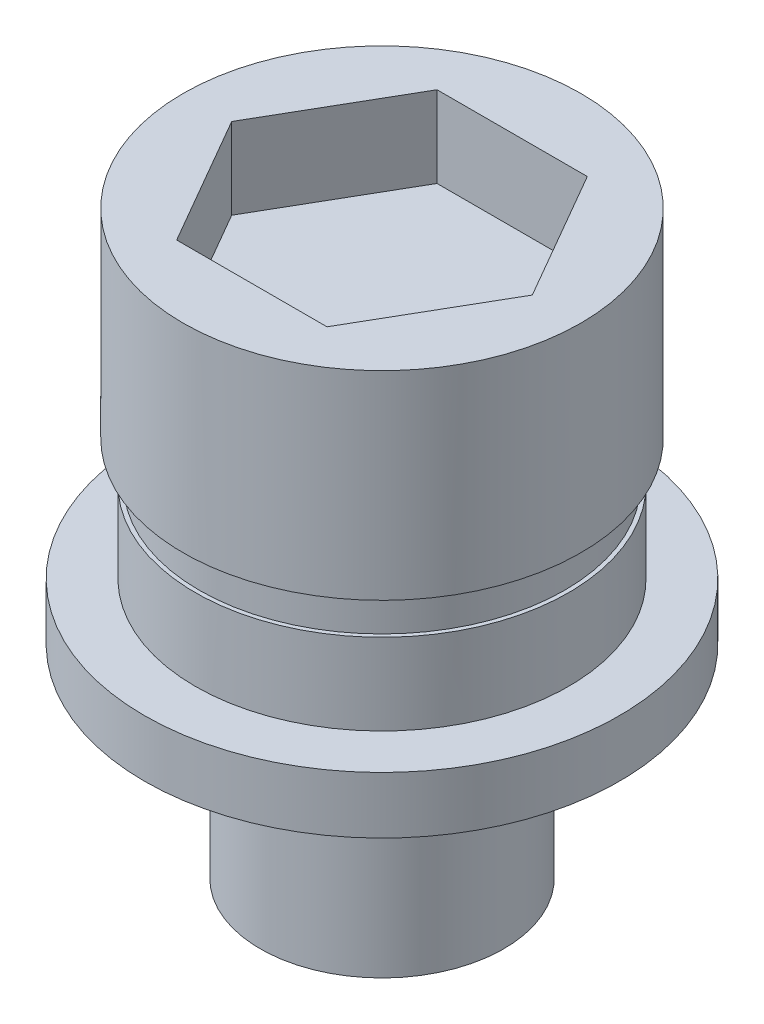
ISO-10303-21;
HEADER;
FILE_DESCRIPTION(('STEP AP214'),'2;1');
FILE_NAME('part.step','',(''),(''),'','','');
FILE_SCHEMA(('AUTOMOTIVE_DESIGN { 1 0 10303 214 1 1 1 1 }'));
ENDSEC;
DATA;
#1=APPLICATION_CONTEXT('core data for automotive mechanical design processes');
#2=APPLICATION_PROTOCOL_DEFINITION('international standard','automotive_design',2000,#1);
#3=PRODUCT_CONTEXT('',#1,'mechanical');
#4=PRODUCT('Part','Part','',(#3));
#5=PRODUCT_RELATED_PRODUCT_CATEGORY('part','',(#4));
#6=PRODUCT_DEFINITION_FORMATION('','',#4);
#7=PRODUCT_DEFINITION_CONTEXT('part definition',#1,'design');
#8=PRODUCT_DEFINITION('design','',#6,#7);
#9=PRODUCT_DEFINITION_SHAPE('','',#8);
#10=(LENGTH_UNIT() NAMED_UNIT(*) SI_UNIT(.MILLI.,.METRE.));
#11=(NAMED_UNIT(*) PLANE_ANGLE_UNIT() SI_UNIT($,.RADIAN.));
#12=(NAMED_UNIT(*) SI_UNIT($,.STERADIAN.) SOLID_ANGLE_UNIT());
#13=UNCERTAINTY_MEASURE_WITH_UNIT(LENGTH_MEASURE(1.E-05),#10,'distance_accuracy_value','');
#14=(GEOMETRIC_REPRESENTATION_CONTEXT(3) GLOBAL_UNCERTAINTY_ASSIGNED_CONTEXT((#13)) GLOBAL_UNIT_ASSIGNED_CONTEXT((#10,
#11,#12)) REPRESENTATION_CONTEXT('',''));
#15=CARTESIAN_POINT('',(0.,0.,0.));
#16=DIRECTION('',(0.,0.,1.));
#17=DIRECTION('',(1.,0.,0.));
#18=AXIS2_PLACEMENT_3D('',#15,#16,#17);
#19=CARTESIAN_POINT('',(0.,1.4,0.));
#20=DIRECTION('',(0.,-1.,0.));
#21=DIRECTION('',(0.,0.,-1.));
#22=AXIS2_PLACEMENT_3D('',#19,#20,#21);
#23=CYLINDRICAL_SURFACE('',#22,5.85);
#24=CARTESIAN_POINT('',(0.,1.4,0.));
#25=DIRECTION('',(0.,1.,0.));
#26=DIRECTION('',(0.,0.,1.));
#27=AXIS2_PLACEMENT_3D('',#24,#25,#26);
#28=CIRCLE('',#27,5.85);
#29=CARTESIAN_POINT('',(0.,1.4,5.85));
#30=VERTEX_POINT('',#29);
#31=EDGE_CURVE('E159',#30,#30,#28,.T.);
#32=ORIENTED_EDGE('',*,*,#31,.F.);
#33=EDGE_LOOP('',(#32));
#34=FACE_BOUND('',#33,.T.);
#35=CARTESIAN_POINT('',(0.,0.,0.));
#36=DIRECTION('',(0.,1.,0.));
#37=DIRECTION('',(0.,0.,1.));
#38=AXIS2_PLACEMENT_3D('',#35,#36,#37);
#39=CIRCLE('',#38,5.85);
#40=CARTESIAN_POINT('',(0.,0.,5.85));
#41=VERTEX_POINT('',#40);
#42=EDGE_CURVE('E156',#41,#41,#39,.T.);
#43=ORIENTED_EDGE('',*,*,#42,.T.);
#44=EDGE_LOOP('',(#43));
#45=FACE_BOUND('',#44,.T.);
#46=ADVANCED_FACE('F35',(#34,#45),#23,.T.);
#47=CARTESIAN_POINT('',(0.,1.4,0.));
#48=DIRECTION('',(0.,1.,0.));
#49=DIRECTION('',(0.,0.,1.));
#50=AXIS2_PLACEMENT_3D('',#47,#48,#49);
#51=PLANE('',#50);
#52=CARTESIAN_POINT('',(0.,1.4,0.));
#53=DIRECTION('',(0.,1.,0.));
#54=DIRECTION('',(0.,0.,1.));
#55=AXIS2_PLACEMENT_3D('',#52,#53,#54);
#56=CIRCLE('',#55,4.6);
#57=CARTESIAN_POINT('',(0.,1.4,4.6));
#58=VERTEX_POINT('',#57);
#59=EDGE_CURVE('E43',#58,#58,#56,.T.);
#60=ORIENTED_EDGE('',*,*,#59,.F.);
#61=EDGE_LOOP('',(#60));
#62=FACE_BOUND('',#61,.T.);
#63=ORIENTED_EDGE('',*,*,#31,.T.);
#64=EDGE_LOOP('',(#63));
#65=FACE_BOUND('',#64,.T.);
#66=ADVANCED_FACE('F168',(#62,#65),#51,.T.);
#67=CARTESIAN_POINT('',(0.,0.,0.));
#68=DIRECTION('',(0.,1.,0.));
#69=DIRECTION('',(0.,0.,1.));
#70=AXIS2_PLACEMENT_3D('',#67,#68,#69);
#71=PLANE('',#70);
#72=CARTESIAN_POINT('',(0.,0.,0.));
#73=DIRECTION('',(0.,-1.,0.));
#74=DIRECTION('',(0.,0.,-1.));
#75=AXIS2_PLACEMENT_3D('',#72,#73,#74);
#76=CIRCLE('',#75,3.);
#77=CARTESIAN_POINT('',(0.,0.,-3.));
#78=VERTEX_POINT('',#77);
#79=EDGE_CURVE('E11',#78,#78,#76,.T.);
#80=ORIENTED_EDGE('',*,*,#79,.F.);
#81=EDGE_LOOP('',(#80));
#82=FACE_BOUND('',#81,.T.);
#83=ORIENTED_EDGE('',*,*,#42,.F.);
#84=EDGE_LOOP('',(#83));
#85=FACE_BOUND('',#84,.T.);
#86=ADVANCED_FACE('F165',(#82,#85),#71,.F.);
#87=CARTESIAN_POINT('',(0.,3.4,0.));
#88=DIRECTION('',(0.,-1.,0.));
#89=DIRECTION('',(0.,0.,-1.));
#90=AXIS2_PLACEMENT_3D('',#87,#88,#89);
#91=CYLINDRICAL_SURFACE('',#90,4.6);
#92=CARTESIAN_POINT('',(0.,3.4,0.));
#93=DIRECTION('',(0.,-1.,0.));
#94=DIRECTION('',(0.,0.,-1.));
#95=AXIS2_PLACEMENT_3D('',#92,#93,#94);
#96=CIRCLE('',#95,4.6);
#97=CARTESIAN_POINT('',(0.,3.4,-4.6));
#98=VERTEX_POINT('',#97);
#99=EDGE_CURVE('E148',#98,#98,#96,.T.);
#100=ORIENTED_EDGE('',*,*,#99,.T.);
#101=EDGE_LOOP('',(#100));
#102=FACE_BOUND('',#101,.T.);
#103=ORIENTED_EDGE('',*,*,#59,.T.);
#104=EDGE_LOOP('',(#103));
#105=FACE_BOUND('',#104,.T.);
#106=ADVANCED_FACE('F167',(#102,#105),#91,.T.);
#107=CARTESIAN_POINT('',(0.,4.4,0.));
#108=DIRECTION('',(0.,-1.,0.));
#109=DIRECTION('',(0.,0.,-1.));
#110=AXIS2_PLACEMENT_3D('',#107,#108,#109);
#111=PLANE('',#110);
#112=CARTESIAN_POINT('',(0.,4.4,0.));
#113=DIRECTION('',(0.,-1.,0.));
#114=DIRECTION('',(0.,0.,-1.));
#115=AXIS2_PLACEMENT_3D('',#112,#113,#114);
#116=CIRCLE('',#115,4.5);
#117=CARTESIAN_POINT('',(0.,4.4,-4.5));
#118=VERTEX_POINT('',#117);
#119=EDGE_CURVE('E145',#118,#118,#116,.T.);
#120=ORIENTED_EDGE('',*,*,#119,.F.);
#121=EDGE_LOOP('',(#120));
#122=FACE_BOUND('',#121,.T.);
#123=CARTESIAN_POINT('',(0.,4.4,0.));
#124=DIRECTION('',(0.,-1.,0.));
#125=DIRECTION('',(0.,0.,-1.));
#126=AXIS2_PLACEMENT_3D('',#123,#124,#125);
#127=CIRCLE('',#126,4.9);
#128=CARTESIAN_POINT('',(0.,4.4,-4.9));
#129=VERTEX_POINT('',#128);
#130=EDGE_CURVE('E38',#129,#129,#127,.T.);
#131=ORIENTED_EDGE('',*,*,#130,.T.);
#132=EDGE_LOOP('',(#131));
#133=FACE_BOUND('',#132,.T.);
#134=ADVANCED_FACE('F174',(#122,#133),#111,.T.);
#135=CARTESIAN_POINT('',(0.,3.4,0.));
#136=DIRECTION('',(0.,-1.,0.));
#137=DIRECTION('',(0.,0.,-1.));
#138=AXIS2_PLACEMENT_3D('',#135,#136,#137);
#139=PLANE('',#138);
#140=CARTESIAN_POINT('',(0.,3.4,0.));
#141=DIRECTION('',(0.,-1.,0.));
#142=DIRECTION('',(0.,0.,-1.));
#143=AXIS2_PLACEMENT_3D('',#140,#141,#142);
#144=CIRCLE('',#143,4.5);
#145=CARTESIAN_POINT('',(0.,3.4,-4.5));
#146=VERTEX_POINT('',#145);
#147=EDGE_CURVE('E139',#146,#146,#144,.T.);
#148=ORIENTED_EDGE('',*,*,#147,.T.);
#149=EDGE_LOOP('',(#148));
#150=FACE_BOUND('',#149,.T.);
#151=ORIENTED_EDGE('',*,*,#99,.F.);
#152=EDGE_LOOP('',(#151));
#153=FACE_BOUND('',#152,.T.);
#154=ADVANCED_FACE('F207',(#150,#153),#139,.F.);
#155=CARTESIAN_POINT('',(0.,4.4,0.));
#156=DIRECTION('',(0.,-1.,0.));
#157=DIRECTION('',(0.,0.,-1.));
#158=AXIS2_PLACEMENT_3D('',#155,#156,#157);
#159=CYLINDRICAL_SURFACE('',#158,4.5);
#160=ORIENTED_EDGE('',*,*,#119,.T.);
#161=EDGE_LOOP('',(#160));
#162=FACE_BOUND('',#161,.T.);
#163=ORIENTED_EDGE('',*,*,#147,.F.);
#164=EDGE_LOOP('',(#163));
#165=FACE_BOUND('',#164,.T.);
#166=ADVANCED_FACE('F218',(#162,#165),#159,.T.);
#167=CARTESIAN_POINT('',(0.,9.3,0.));
#168=DIRECTION('',(0.,1.,0.));
#169=DIRECTION('',(0.,0.,1.));
#170=AXIS2_PLACEMENT_3D('',#167,#168,#169);
#171=PLANE('',#170);
#172=DIRECTION('',(-0.499999999999995,0.,0.866025403784442));
#173=VECTOR('',#172,1.);
#174=CARTESIAN_POINT('',(-1.85128796616693,9.3,-3.20652481684189));
#175=LINE('',#174,#173);
#176=CARTESIAN_POINT('',(-1.85128796616693,9.3,-3.20652481684189));
#177=VERTEX_POINT('',#176);
#178=CARTESIAN_POINT('',(-3.70257593233379,9.3,0.));
#179=VERTEX_POINT('',#178);
#180=EDGE_CURVE('E51',#177,#179,#175,.T.);
#181=ORIENTED_EDGE('',*,*,#180,.F.);
#182=DIRECTION('',(-1.,0.,0.));
#183=VECTOR('',#182,1.);
#184=CARTESIAN_POINT('',(1.85128796616686,9.3,-3.20652481684193));
#185=LINE('',#184,#183);
#186=CARTESIAN_POINT('',(1.85128796616686,9.3,-3.20652481684193));
#187=VERTEX_POINT('',#186);
#188=EDGE_CURVE('E135',#187,#177,#185,.T.);
#189=ORIENTED_EDGE('',*,*,#188,.F.);
#190=DIRECTION('',(-0.500000000000007,0.,-0.866025403784435));
#191=VECTOR('',#190,1.);
#192=CARTESIAN_POINT('',(3.70257593233379,9.3,0.));
#193=LINE('',#192,#191);
#194=CARTESIAN_POINT('',(3.70257593233379,9.3,0.));
#195=VERTEX_POINT('',#194);
#196=EDGE_CURVE('E133',#195,#187,#193,.T.);
#197=ORIENTED_EDGE('',*,*,#196,.F.);
#198=DIRECTION('',(0.499999999999995,0.,-0.866025403784442));
#199=VECTOR('',#198,1.);
#200=CARTESIAN_POINT('',(1.85128796616691,9.3,3.20652481684191));
#201=LINE('',#200,#199);
#202=CARTESIAN_POINT('',(1.85128796616691,9.3,3.20652481684191));
#203=VERTEX_POINT('',#202);
#204=EDGE_CURVE('E99',#203,#195,#201,.T.);
#205=ORIENTED_EDGE('',*,*,#204,.F.);
#206=DIRECTION('',(1.,0.,0.));
#207=VECTOR('',#206,1.);
#208=CARTESIAN_POINT('',(-1.85128796616689,9.3,3.20652481684192));
#209=LINE('',#208,#207);
#210=CARTESIAN_POINT('',(-1.85128796616689,9.3,3.20652481684192));
#211=VERTEX_POINT('',#210);
#212=EDGE_CURVE('E129',#211,#203,#209,.T.);
#213=ORIENTED_EDGE('',*,*,#212,.F.);
#214=DIRECTION('',(0.500000000000001,0.,0.866025403784438));
#215=VECTOR('',#214,1.);
#216=CARTESIAN_POINT('',(-3.70257593233379,9.3,0.));
#217=LINE('',#216,#215);
#218=EDGE_CURVE('E125',#179,#211,#217,.T.);
#219=ORIENTED_EDGE('',*,*,#218,.F.);
#220=EDGE_LOOP('',(#181,#189,#197,#205,#213,#219));
#221=FACE_BOUND('',#220,.T.);
#222=CARTESIAN_POINT('',(0.,9.3,0.));
#223=DIRECTION('',(0.,1.,0.));
#224=DIRECTION('',(0.,0.,1.));
#225=AXIS2_PLACEMENT_3D('',#222,#223,#224);
#226=CIRCLE('',#225,4.9);
#227=CARTESIAN_POINT('',(0.,9.3,4.9));
#228=VERTEX_POINT('',#227);
#229=EDGE_CURVE('E153',#228,#228,#226,.T.);
#230=ORIENTED_EDGE('',*,*,#229,.T.);
#231=EDGE_LOOP('',(#230));
#232=FACE_BOUND('',#231,.T.);
#233=ADVANCED_FACE('F228',(#221,#232),#171,.T.);
#234=CARTESIAN_POINT('',(0.,9.3,0.));
#235=DIRECTION('',(0.,-1.,0.));
#236=DIRECTION('',(0.,0.,-1.));
#237=AXIS2_PLACEMENT_3D('',#234,#235,#236);
#238=CYLINDRICAL_SURFACE('',#237,4.9);
#239=ORIENTED_EDGE('',*,*,#229,.F.);
#240=EDGE_LOOP('',(#239));
#241=FACE_BOUND('',#240,.T.);
#242=ORIENTED_EDGE('',*,*,#130,.F.);
#243=EDGE_LOOP('',(#242));
#244=FACE_BOUND('',#243,.T.);
#245=ADVANCED_FACE('F236',(#241,#244),#238,.T.);
#246=CARTESIAN_POINT('',(-1.85128796616693,7.3,-3.20652481684189));
#247=DIRECTION('',(-0.866025403784441,0.,-0.499999999999995));
#248=DIRECTION('',(-0.499999999999995,0.,0.866025403784442));
#249=AXIS2_PLACEMENT_3D('',#246,#247,#248);
#250=PLANE('',#249);
#251=ORIENTED_EDGE('',*,*,#180,.T.);
#252=DIRECTION('',(0.,1.,0.));
#253=VECTOR('',#252,1.);
#254=CARTESIAN_POINT('',(-3.70257593233379,7.3,0.));
#255=LINE('',#254,#253);
#256=CARTESIAN_POINT('',(-3.70257593233379,7.3,0.));
#257=VERTEX_POINT('',#256);
#258=EDGE_CURVE('E81',#257,#179,#255,.T.);
#259=ORIENTED_EDGE('',*,*,#258,.F.);
#260=DIRECTION('',(-0.499999999999995,0.,0.866025403784442));
#261=VECTOR('',#260,1.);
#262=CARTESIAN_POINT('',(-1.85128796616693,7.3,-3.20652481684189));
#263=LINE('',#262,#261);
#264=CARTESIAN_POINT('',(-1.85128796616693,7.3,-3.20652481684189));
#265=VERTEX_POINT('',#264);
#266=EDGE_CURVE('E137',#265,#257,#263,.T.);
#267=ORIENTED_EDGE('',*,*,#266,.F.);
#268=DIRECTION('',(0.,1.,0.));
#269=VECTOR('',#268,1.);
#270=CARTESIAN_POINT('',(-1.85128796616693,7.3,-3.20652481684189));
#271=LINE('',#270,#269);
#272=EDGE_CURVE('E59',#265,#177,#271,.T.);
#273=ORIENTED_EDGE('',*,*,#272,.T.);
#274=EDGE_LOOP('',(#251,#259,#267,#273));
#275=FACE_BOUND('',#274,.T.);
#276=ADVANCED_FACE('F240',(#275),#250,.F.);
#277=CARTESIAN_POINT('',(1.85128796616686,7.3,-3.20652481684193));
#278=DIRECTION('',(0.,0.,-1.));
#279=DIRECTION('',(-1.,0.,0.));
#280=AXIS2_PLACEMENT_3D('',#277,#278,#279);
#281=PLANE('',#280);
#282=ORIENTED_EDGE('',*,*,#188,.T.);
#283=ORIENTED_EDGE('',*,*,#272,.F.);
#284=DIRECTION('',(-1.,0.,0.));
#285=VECTOR('',#284,1.);
#286=CARTESIAN_POINT('',(1.85128796616686,7.3,-3.20652481684193));
#287=LINE('',#286,#285);
#288=CARTESIAN_POINT('',(1.85128796616686,7.3,-3.20652481684193));
#289=VERTEX_POINT('',#288);
#290=EDGE_CURVE('E111',#289,#265,#287,.T.);
#291=ORIENTED_EDGE('',*,*,#290,.F.);
#292=DIRECTION('',(0.,1.,0.));
#293=VECTOR('',#292,1.);
#294=CARTESIAN_POINT('',(1.85128796616686,7.3,-3.20652481684193));
#295=LINE('',#294,#293);
#296=EDGE_CURVE('E103',#289,#187,#295,.T.);
#297=ORIENTED_EDGE('',*,*,#296,.T.);
#298=EDGE_LOOP('',(#282,#283,#291,#297));
#299=FACE_BOUND('',#298,.T.);
#300=ADVANCED_FACE('F256',(#299),#281,.F.);
#301=CARTESIAN_POINT('',(3.70257593233379,7.3,0.));
#302=DIRECTION('',(0.866025403784435,0.,-0.500000000000007));
#303=DIRECTION('',(-0.500000000000007,0.,-0.866025403784435));
#304=AXIS2_PLACEMENT_3D('',#301,#302,#303);
#305=PLANE('',#304);
#306=ORIENTED_EDGE('',*,*,#196,.T.);
#307=ORIENTED_EDGE('',*,*,#296,.F.);
#308=DIRECTION('',(-0.500000000000007,0.,-0.866025403784435));
#309=VECTOR('',#308,1.);
#310=CARTESIAN_POINT('',(3.70257593233379,7.3,0.));
#311=LINE('',#310,#309);
#312=CARTESIAN_POINT('',(3.70257593233379,7.3,0.));
#313=VERTEX_POINT('',#312);
#314=EDGE_CURVE('E107',#313,#289,#311,.T.);
#315=ORIENTED_EDGE('',*,*,#314,.F.);
#316=DIRECTION('',(0.,1.,0.));
#317=VECTOR('',#316,1.);
#318=CARTESIAN_POINT('',(3.70257593233379,7.3,0.));
#319=LINE('',#318,#317);
#320=EDGE_CURVE('E92',#313,#195,#319,.T.);
#321=ORIENTED_EDGE('',*,*,#320,.T.);
#322=EDGE_LOOP('',(#306,#307,#315,#321));
#323=FACE_BOUND('',#322,.T.);
#324=ADVANCED_FACE('F108',(#323),#305,.F.);
#325=CARTESIAN_POINT('',(1.85128796616691,7.3,3.20652481684191));
#326=DIRECTION('',(0.866025403784442,0.,0.499999999999995));
#327=DIRECTION('',(0.499999999999995,0.,-0.866025403784442));
#328=AXIS2_PLACEMENT_3D('',#325,#326,#327);
#329=PLANE('',#328);
#330=ORIENTED_EDGE('',*,*,#204,.T.);
#331=ORIENTED_EDGE('',*,*,#320,.F.);
#332=DIRECTION('',(0.499999999999995,0.,-0.866025403784442));
#333=VECTOR('',#332,1.);
#334=CARTESIAN_POINT('',(1.85128796616691,7.3,3.20652481684191));
#335=LINE('',#334,#333);
#336=CARTESIAN_POINT('',(1.85128796616691,7.3,3.20652481684191));
#337=VERTEX_POINT('',#336);
#338=EDGE_CURVE('E96',#337,#313,#335,.T.);
#339=ORIENTED_EDGE('',*,*,#338,.F.);
#340=DIRECTION('',(0.,1.,0.));
#341=VECTOR('',#340,1.);
#342=CARTESIAN_POINT('',(1.85128796616691,7.3,3.20652481684191));
#343=LINE('',#342,#341);
#344=EDGE_CURVE('E104',#337,#203,#343,.T.);
#345=ORIENTED_EDGE('',*,*,#344,.T.);
#346=EDGE_LOOP('',(#330,#331,#339,#345));
#347=FACE_BOUND('',#346,.T.);
#348=ADVANCED_FACE('F94',(#347),#329,.F.);
#349=CARTESIAN_POINT('',(-1.85128796616689,7.3,3.20652481684192));
#350=DIRECTION('',(0.,0.,1.));
#351=DIRECTION('',(1.,0.,0.));
#352=AXIS2_PLACEMENT_3D('',#349,#350,#351);
#353=PLANE('',#352);
#354=ORIENTED_EDGE('',*,*,#212,.T.);
#355=ORIENTED_EDGE('',*,*,#344,.F.);
#356=DIRECTION('',(1.,0.,0.));
#357=VECTOR('',#356,1.);
#358=CARTESIAN_POINT('',(-1.85128796616689,7.3,3.20652481684192));
#359=LINE('',#358,#357);
#360=CARTESIAN_POINT('',(-1.85128796616689,7.3,3.20652481684192));
#361=VERTEX_POINT('',#360);
#362=EDGE_CURVE('E117',#361,#337,#359,.T.);
#363=ORIENTED_EDGE('',*,*,#362,.F.);
#364=DIRECTION('',(0.,1.,0.));
#365=VECTOR('',#364,1.);
#366=CARTESIAN_POINT('',(-1.85128796616689,7.3,3.20652481684192));
#367=LINE('',#366,#365);
#368=EDGE_CURVE('E142',#361,#211,#367,.T.);
#369=ORIENTED_EDGE('',*,*,#368,.T.);
#370=EDGE_LOOP('',(#354,#355,#363,#369));
#371=FACE_BOUND('',#370,.T.);
#372=ADVANCED_FACE('F281',(#371),#353,.F.);
#373=CARTESIAN_POINT('',(-3.70257593233379,7.3,0.));
#374=DIRECTION('',(-0.866025403784438,0.,0.500000000000001));
#375=DIRECTION('',(0.500000000000001,0.,0.866025403784438));
#376=AXIS2_PLACEMENT_3D('',#373,#374,#375);
#377=PLANE('',#376);
#378=ORIENTED_EDGE('',*,*,#218,.T.);
#379=ORIENTED_EDGE('',*,*,#368,.F.);
#380=DIRECTION('',(0.500000000000001,0.,0.866025403784438));
#381=VECTOR('',#380,1.);
#382=CARTESIAN_POINT('',(-3.70257593233379,7.3,0.));
#383=LINE('',#382,#381);
#384=EDGE_CURVE('E119',#257,#361,#383,.T.);
#385=ORIENTED_EDGE('',*,*,#384,.F.);
#386=ORIENTED_EDGE('',*,*,#258,.T.);
#387=EDGE_LOOP('',(#378,#379,#385,#386));
#388=FACE_BOUND('',#387,.T.);
#389=ADVANCED_FACE('F290',(#388),#377,.F.);
#390=CARTESIAN_POINT('',(0.,7.3,0.));
#391=DIRECTION('',(0.,1.,0.));
#392=DIRECTION('',(0.,0.,1.));
#393=AXIS2_PLACEMENT_3D('',#390,#391,#392);
#394=PLANE('',#393);
#395=ORIENTED_EDGE('',*,*,#266,.T.);
#396=ORIENTED_EDGE('',*,*,#384,.T.);
#397=ORIENTED_EDGE('',*,*,#362,.T.);
#398=ORIENTED_EDGE('',*,*,#338,.T.);
#399=ORIENTED_EDGE('',*,*,#314,.T.);
#400=ORIENTED_EDGE('',*,*,#290,.T.);
#401=EDGE_LOOP('',(#395,#396,#397,#398,#399,#400));
#402=FACE_BOUND('',#401,.T.);
#403=ADVANCED_FACE('F114',(#402),#394,.T.);
#404=CARTESIAN_POINT('',(0.,-5.,0.));
#405=DIRECTION('',(0.,1.,0.));
#406=DIRECTION('',(0.,0.,1.));
#407=AXIS2_PLACEMENT_3D('',#404,#405,#406);
#408=CYLINDRICAL_SURFACE('',#407,3.);
#409=CARTESIAN_POINT('',(0.,-5.,0.));
#410=DIRECTION('',(0.,-1.,0.));
#411=DIRECTION('',(0.,0.,-1.));
#412=AXIS2_PLACEMENT_3D('',#409,#410,#411);
#413=CIRCLE('',#412,3.);
#414=CARTESIAN_POINT('',(0.,-5.,-3.));
#415=VERTEX_POINT('',#414);
#416=EDGE_CURVE('E126',#415,#415,#413,.T.);
#417=ORIENTED_EDGE('',*,*,#416,.F.);
#418=EDGE_LOOP('',(#417));
#419=FACE_BOUND('',#418,.T.);
#420=ORIENTED_EDGE('',*,*,#79,.T.);
#421=EDGE_LOOP('',(#420));
#422=FACE_BOUND('',#421,.T.);
#423=ADVANCED_FACE('F308',(#419,#422),#408,.T.);
#424=CARTESIAN_POINT('',(0.,-5.,0.));
#425=DIRECTION('',(0.,-1.,0.));
#426=DIRECTION('',(0.,0.,-1.));
#427=AXIS2_PLACEMENT_3D('',#424,#425,#426);
#428=PLANE('',#427);
#429=ORIENTED_EDGE('',*,*,#416,.T.);
#430=EDGE_LOOP('',(#429));
#431=FACE_BOUND('',#430,.T.);
#432=ADVANCED_FACE('F321',(#431),#428,.T.);
#433=CLOSED_SHELL('',(#46,#66,#86,#106,#134,#154,#166,#233,#245,#276,#300,#324,#348,#372,#389,
#403,#423,#432));
#434=MANIFOLD_SOLID_BREP('B2',#433);
#435=ADVANCED_BREP_SHAPE_REPRESENTATION('',(#18,#434),#14);
#436=SHAPE_DEFINITION_REPRESENTATION(#9,#435);
ENDSEC;
END-ISO-10303-21;
